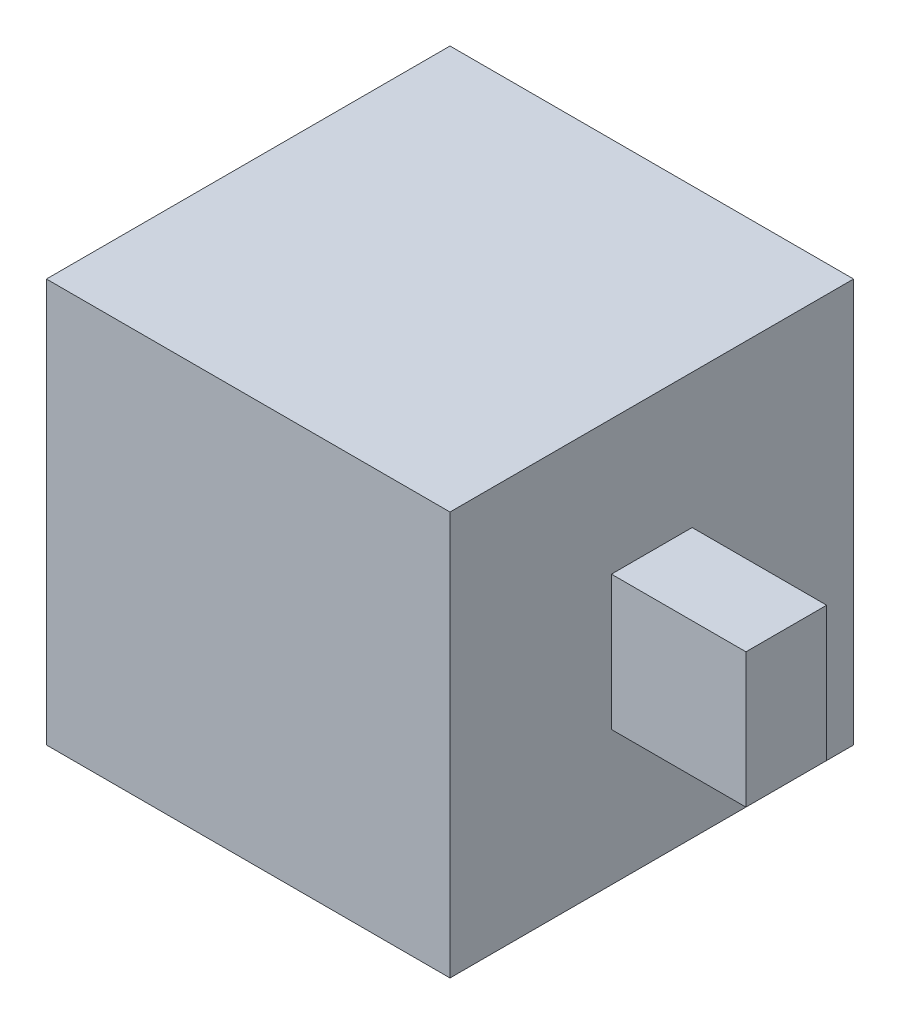
ISO-10303-21;
HEADER;
FILE_DESCRIPTION(('STEP AP214'),'2;1');
FILE_NAME('part.step','',(''),(''),'','','');
FILE_SCHEMA(('AUTOMOTIVE_DESIGN { 1 0 10303 214 1 1 1 1 }'));
ENDSEC;
DATA;
#1=APPLICATION_CONTEXT('core data for automotive mechanical design processes');
#2=APPLICATION_PROTOCOL_DEFINITION('international standard','automotive_design',2000,#1);
#3=PRODUCT_CONTEXT('',#1,'mechanical');
#4=PRODUCT('Part','Part','',(#3));
#5=PRODUCT_RELATED_PRODUCT_CATEGORY('part','',(#4));
#6=PRODUCT_DEFINITION_FORMATION('','',#4);
#7=PRODUCT_DEFINITION_CONTEXT('part definition',#1,'design');
#8=PRODUCT_DEFINITION('design','',#6,#7);
#9=PRODUCT_DEFINITION_SHAPE('','',#8);
#10=(LENGTH_UNIT() NAMED_UNIT(*) SI_UNIT(.MILLI.,.METRE.));
#11=(NAMED_UNIT(*) PLANE_ANGLE_UNIT() SI_UNIT($,.RADIAN.));
#12=(NAMED_UNIT(*) SI_UNIT($,.STERADIAN.) SOLID_ANGLE_UNIT());
#13=UNCERTAINTY_MEASURE_WITH_UNIT(LENGTH_MEASURE(1.E-05),#10,'distance_accuracy_value','');
#14=(GEOMETRIC_REPRESENTATION_CONTEXT(3) GLOBAL_UNCERTAINTY_ASSIGNED_CONTEXT((#13)) GLOBAL_UNIT_ASSIGNED_CONTEXT((#10,
#11,#12)) REPRESENTATION_CONTEXT('',''));
#15=CARTESIAN_POINT('',(0.,0.,0.));
#16=DIRECTION('',(0.,0.,1.));
#17=DIRECTION('',(1.,0.,0.));
#18=AXIS2_PLACEMENT_3D('',#15,#16,#17);
#19=CARTESIAN_POINT('',(30.,0.,0.));
#20=DIRECTION('',(-1.,0.,0.));
#21=DIRECTION('',(0.,0.,1.));
#22=AXIS2_PLACEMENT_3D('',#19,#20,#21);
#23=PLANE('',#22);
#24=DIRECTION('',(0.,-1.,0.));
#25=VECTOR('',#24,1.);
#26=CARTESIAN_POINT('',(30.,0.,0.));
#27=LINE('',#26,#25);
#28=CARTESIAN_POINT('',(30.,30.,0.));
#29=VERTEX_POINT('',#28);
#30=CARTESIAN_POINT('',(30.,0.,0.));
#31=VERTEX_POINT('',#30);
#32=EDGE_CURVE('E144',#29,#31,#27,.T.);
#33=ORIENTED_EDGE('',*,*,#32,.T.);
#34=DIRECTION('',(0.,0.,-1.));
#35=VECTOR('',#34,1.);
#36=CARTESIAN_POINT('',(30.,0.,0.));
#37=LINE('',#36,#35);
#38=CARTESIAN_POINT('',(30.,0.,-30.));
#39=VERTEX_POINT('',#38);
#40=EDGE_CURVE('E148',#31,#39,#37,.T.);
#41=ORIENTED_EDGE('',*,*,#40,.T.);
#42=DIRECTION('',(0.,1.,0.));
#43=VECTOR('',#42,1.);
#44=CARTESIAN_POINT('',(30.,0.,-30.));
#45=LINE('',#44,#43);
#46=CARTESIAN_POINT('',(30.,30.,-30.));
#47=VERTEX_POINT('',#46);
#48=EDGE_CURVE('E152',#39,#47,#45,.T.);
#49=ORIENTED_EDGE('',*,*,#48,.T.);
#50=DIRECTION('',(0.,0.,1.));
#51=VECTOR('',#50,1.);
#52=CARTESIAN_POINT('',(30.,30.,0.));
#53=LINE('',#52,#51);
#54=EDGE_CURVE('E155',#47,#29,#53,.T.);
#55=ORIENTED_EDGE('',*,*,#54,.T.);
#56=EDGE_LOOP('',(#33,#41,#49,#55));
#57=FACE_BOUND('',#56,.T.);
#58=DIRECTION('',(0.,-1.,0.));
#59=VECTOR('',#58,1.);
#60=CARTESIAN_POINT('',(30.,20.,-12.));
#61=LINE('',#60,#59);
#62=CARTESIAN_POINT('',(30.,20.,-12.));
#63=VERTEX_POINT('',#62);
#64=CARTESIAN_POINT('',(30.,10.,-12.));
#65=VERTEX_POINT('',#64);
#66=EDGE_CURVE('E59',#63,#65,#61,.T.);
#67=ORIENTED_EDGE('',*,*,#66,.F.);
#68=DIRECTION('',(0.,0.,-1.));
#69=VECTOR('',#68,1.);
#70=CARTESIAN_POINT('',(30.,20.,-12.));
#71=LINE('',#70,#69);
#72=CARTESIAN_POINT('',(30.,20.,-18.));
#73=VERTEX_POINT('',#72);
#74=EDGE_CURVE('E64',#63,#73,#71,.T.);
#75=ORIENTED_EDGE('',*,*,#74,.T.);
#76=DIRECTION('',(0.,-1.,0.));
#77=VECTOR('',#76,1.);
#78=CARTESIAN_POINT('',(30.,20.,-18.));
#79=LINE('',#78,#77);
#80=CARTESIAN_POINT('',(30.,10.,-18.));
#81=VERTEX_POINT('',#80);
#82=EDGE_CURVE('E309',#73,#81,#79,.T.);
#83=ORIENTED_EDGE('',*,*,#82,.T.);
#84=DIRECTION('',(0.,0.,-1.));
#85=VECTOR('',#84,1.);
#86=CARTESIAN_POINT('',(30.,10.,-12.));
#87=LINE('',#86,#85);
#88=EDGE_CURVE('E312',#65,#81,#87,.T.);
#89=ORIENTED_EDGE('',*,*,#88,.F.);
#90=EDGE_LOOP('',(#67,#75,#83,#89));
#91=FACE_BOUND('',#90,.T.);
#92=ADVANCED_FACE('F43',(#57,#91),#23,.F.);
#93=CARTESIAN_POINT('',(30.,0.,0.));
#94=DIRECTION('',(0.,0.,-1.));
#95=DIRECTION('',(0.,1.,0.));
#96=AXIS2_PLACEMENT_3D('',#93,#94,#95);
#97=PLANE('',#96);
#98=DIRECTION('',(0.,-1.,0.));
#99=VECTOR('',#98,1.);
#100=CARTESIAN_POINT('',(0.,0.,0.));
#101=LINE('',#100,#99);
#102=CARTESIAN_POINT('',(0.,30.,0.));
#103=VERTEX_POINT('',#102);
#104=CARTESIAN_POINT('',(0.,0.,0.));
#105=VERTEX_POINT('',#104);
#106=EDGE_CURVE('E133',#103,#105,#101,.T.);
#107=ORIENTED_EDGE('',*,*,#106,.T.);
#108=DIRECTION('',(-1.,0.,0.));
#109=VECTOR('',#108,1.);
#110=CARTESIAN_POINT('',(30.,0.,0.));
#111=LINE('',#110,#109);
#112=EDGE_CURVE('E11',#31,#105,#111,.T.);
#113=ORIENTED_EDGE('',*,*,#112,.F.);
#114=ORIENTED_EDGE('',*,*,#32,.F.);
#115=DIRECTION('',(-1.,0.,0.));
#116=VECTOR('',#115,1.);
#117=CARTESIAN_POINT('',(30.,30.,0.));
#118=LINE('',#117,#116);
#119=EDGE_CURVE('E157',#29,#103,#118,.T.);
#120=ORIENTED_EDGE('',*,*,#119,.T.);
#121=EDGE_LOOP('',(#107,#113,#114,#120));
#122=FACE_BOUND('',#121,.T.);
#123=ADVANCED_FACE('F45',(#122),#97,.F.);
#124=CARTESIAN_POINT('',(30.,0.,0.));
#125=DIRECTION('',(0.,1.,0.));
#126=DIRECTION('',(0.,0.,1.));
#127=AXIS2_PLACEMENT_3D('',#124,#125,#126);
#128=PLANE('',#127);
#129=DIRECTION('',(0.,0.,-1.));
#130=VECTOR('',#129,1.);
#131=CARTESIAN_POINT('',(0.,0.,0.));
#132=LINE('',#131,#130);
#133=CARTESIAN_POINT('',(0.,0.,-30.));
#134=VERTEX_POINT('',#133);
#135=EDGE_CURVE('E138',#105,#134,#132,.T.);
#136=ORIENTED_EDGE('',*,*,#135,.T.);
#137=DIRECTION('',(-1.,0.,0.));
#138=VECTOR('',#137,1.);
#139=CARTESIAN_POINT('',(30.,0.,-30.));
#140=LINE('',#139,#138);
#141=EDGE_CURVE('E52',#39,#134,#140,.T.);
#142=ORIENTED_EDGE('',*,*,#141,.F.);
#143=ORIENTED_EDGE('',*,*,#40,.F.);
#144=ORIENTED_EDGE('',*,*,#112,.T.);
#145=EDGE_LOOP('',(#136,#142,#143,#144));
#146=FACE_BOUND('',#145,.T.);
#147=ADVANCED_FACE('F193',(#146),#128,.F.);
#148=CARTESIAN_POINT('',(30.,0.,-30.));
#149=DIRECTION('',(0.,0.,1.));
#150=DIRECTION('',(0.,-1.,0.));
#151=AXIS2_PLACEMENT_3D('',#148,#149,#150);
#152=PLANE('',#151);
#153=DIRECTION('',(0.,1.,0.));
#154=VECTOR('',#153,1.);
#155=CARTESIAN_POINT('',(0.,0.,-30.));
#156=LINE('',#155,#154);
#157=CARTESIAN_POINT('',(0.,30.,-30.));
#158=VERTEX_POINT('',#157);
#159=EDGE_CURVE('E161',#134,#158,#156,.T.);
#160=ORIENTED_EDGE('',*,*,#159,.T.);
#161=DIRECTION('',(-1.,0.,0.));
#162=VECTOR('',#161,1.);
#163=CARTESIAN_POINT('',(30.,30.,-30.));
#164=LINE('',#163,#162);
#165=EDGE_CURVE('E169',#47,#158,#164,.T.);
#166=ORIENTED_EDGE('',*,*,#165,.F.);
#167=ORIENTED_EDGE('',*,*,#48,.F.);
#168=ORIENTED_EDGE('',*,*,#141,.T.);
#169=EDGE_LOOP('',(#160,#166,#167,#168));
#170=FACE_BOUND('',#169,.T.);
#171=ADVANCED_FACE('F178',(#170),#152,.F.);
#172=CARTESIAN_POINT('',(30.,30.,0.));
#173=DIRECTION('',(0.,-1.,0.));
#174=DIRECTION('',(0.,0.,-1.));
#175=AXIS2_PLACEMENT_3D('',#172,#173,#174);
#176=PLANE('',#175);
#177=DIRECTION('',(0.,0.,1.));
#178=VECTOR('',#177,1.);
#179=CARTESIAN_POINT('',(0.,30.,0.));
#180=LINE('',#179,#178);
#181=EDGE_CURVE('E149',#158,#103,#180,.T.);
#182=ORIENTED_EDGE('',*,*,#181,.T.);
#183=ORIENTED_EDGE('',*,*,#119,.F.);
#184=ORIENTED_EDGE('',*,*,#54,.F.);
#185=ORIENTED_EDGE('',*,*,#165,.T.);
#186=EDGE_LOOP('',(#182,#183,#184,#185));
#187=FACE_BOUND('',#186,.T.);
#188=ADVANCED_FACE('F187',(#187),#176,.F.);
#189=CARTESIAN_POINT('',(0.,0.,0.));
#190=DIRECTION('',(-1.,0.,0.));
#191=DIRECTION('',(0.,0.,1.));
#192=AXIS2_PLACEMENT_3D('',#189,#190,#191);
#193=PLANE('',#192);
#194=ORIENTED_EDGE('',*,*,#106,.F.);
#195=ORIENTED_EDGE('',*,*,#181,.F.);
#196=ORIENTED_EDGE('',*,*,#159,.F.);
#197=ORIENTED_EDGE('',*,*,#135,.F.);
#198=EDGE_LOOP('',(#194,#195,#196,#197));
#199=FACE_BOUND('',#198,.T.);
#200=ADVANCED_FACE('F184',(#199),#193,.T.);
#201=CARTESIAN_POINT('',(40.,20.,-12.));
#202=DIRECTION('',(0.,0.,-1.));
#203=DIRECTION('',(0.,1.,0.));
#204=AXIS2_PLACEMENT_3D('',#201,#202,#203);
#205=PLANE('',#204);
#206=ORIENTED_EDGE('',*,*,#66,.T.);
#207=DIRECTION('',(-1.,0.,0.));
#208=VECTOR('',#207,1.);
#209=CARTESIAN_POINT('',(40.,10.,-12.));
#210=LINE('',#209,#208);
#211=CARTESIAN_POINT('',(40.,10.,-12.));
#212=VERTEX_POINT('',#211);
#213=EDGE_CURVE('E113',#212,#65,#210,.T.);
#214=ORIENTED_EDGE('',*,*,#213,.F.);
#215=DIRECTION('',(0.,-1.,0.));
#216=VECTOR('',#215,1.);
#217=CARTESIAN_POINT('',(40.,20.,-12.));
#218=LINE('',#217,#216);
#219=CARTESIAN_POINT('',(40.,20.,-12.));
#220=VERTEX_POINT('',#219);
#221=EDGE_CURVE('E121',#220,#212,#218,.T.);
#222=ORIENTED_EDGE('',*,*,#221,.F.);
#223=DIRECTION('',(-1.,0.,0.));
#224=VECTOR('',#223,1.);
#225=CARTESIAN_POINT('',(40.,20.,-12.));
#226=LINE('',#225,#224);
#227=EDGE_CURVE('E306',#220,#63,#226,.T.);
#228=ORIENTED_EDGE('',*,*,#227,.T.);
#229=EDGE_LOOP('',(#206,#214,#222,#228));
#230=FACE_BOUND('',#229,.T.);
#231=ADVANCED_FACE('F131',(#230),#205,.F.);
#232=CARTESIAN_POINT('',(40.,10.,-12.));
#233=DIRECTION('',(0.,1.,0.));
#234=DIRECTION('',(0.,0.,1.));
#235=AXIS2_PLACEMENT_3D('',#232,#233,#234);
#236=PLANE('',#235);
#237=ORIENTED_EDGE('',*,*,#88,.T.);
#238=DIRECTION('',(-1.,0.,0.));
#239=VECTOR('',#238,1.);
#240=CARTESIAN_POINT('',(40.,10.,-18.));
#241=LINE('',#240,#239);
#242=CARTESIAN_POINT('',(40.,10.,-18.));
#243=VERTEX_POINT('',#242);
#244=EDGE_CURVE('E115',#243,#81,#241,.T.);
#245=ORIENTED_EDGE('',*,*,#244,.F.);
#246=DIRECTION('',(0.,0.,-1.));
#247=VECTOR('',#246,1.);
#248=CARTESIAN_POINT('',(40.,10.,-12.));
#249=LINE('',#248,#247);
#250=EDGE_CURVE('E108',#212,#243,#249,.T.);
#251=ORIENTED_EDGE('',*,*,#250,.F.);
#252=ORIENTED_EDGE('',*,*,#213,.T.);
#253=EDGE_LOOP('',(#237,#245,#251,#252));
#254=FACE_BOUND('',#253,.T.);
#255=ADVANCED_FACE('F111',(#254),#236,.F.);
#256=CARTESIAN_POINT('',(40.,20.,-18.));
#257=DIRECTION('',(0.,0.,-1.));
#258=DIRECTION('',(-1.,0.,0.));
#259=AXIS2_PLACEMENT_3D('',#256,#257,#258);
#260=PLANE('',#259);
#261=ORIENTED_EDGE('',*,*,#82,.F.);
#262=DIRECTION('',(-1.,0.,0.));
#263=VECTOR('',#262,1.);
#264=CARTESIAN_POINT('',(40.,20.,-18.));
#265=LINE('',#264,#263);
#266=CARTESIAN_POINT('',(40.,20.,-18.));
#267=VERTEX_POINT('',#266);
#268=EDGE_CURVE('E140',#267,#73,#265,.T.);
#269=ORIENTED_EDGE('',*,*,#268,.F.);
#270=DIRECTION('',(0.,-1.,0.));
#271=VECTOR('',#270,1.);
#272=CARTESIAN_POINT('',(40.,20.,-18.));
#273=LINE('',#272,#271);
#274=EDGE_CURVE('E120',#267,#243,#273,.T.);
#275=ORIENTED_EDGE('',*,*,#274,.T.);
#276=ORIENTED_EDGE('',*,*,#244,.T.);
#277=EDGE_LOOP('',(#261,#269,#275,#276));
#278=FACE_BOUND('',#277,.T.);
#279=ADVANCED_FACE('F229',(#278),#260,.T.);
#280=CARTESIAN_POINT('',(40.,20.,-12.));
#281=DIRECTION('',(0.,1.,0.));
#282=DIRECTION('',(0.,0.,1.));
#283=AXIS2_PLACEMENT_3D('',#280,#281,#282);
#284=PLANE('',#283);
#285=ORIENTED_EDGE('',*,*,#74,.F.);
#286=ORIENTED_EDGE('',*,*,#227,.F.);
#287=DIRECTION('',(0.,0.,-1.));
#288=VECTOR('',#287,1.);
#289=CARTESIAN_POINT('',(40.,20.,-12.));
#290=LINE('',#289,#288);
#291=EDGE_CURVE('E127',#220,#267,#290,.T.);
#292=ORIENTED_EDGE('',*,*,#291,.T.);
#293=ORIENTED_EDGE('',*,*,#268,.T.);
#294=EDGE_LOOP('',(#285,#286,#292,#293));
#295=FACE_BOUND('',#294,.T.);
#296=ADVANCED_FACE('F235',(#295),#284,.T.);
#297=CARTESIAN_POINT('',(40.,0.,0.));
#298=DIRECTION('',(1.,0.,0.));
#299=DIRECTION('',(0.,0.,-1.));
#300=AXIS2_PLACEMENT_3D('',#297,#298,#299);
#301=PLANE('',#300);
#302=ORIENTED_EDGE('',*,*,#221,.T.);
#303=ORIENTED_EDGE('',*,*,#250,.T.);
#304=ORIENTED_EDGE('',*,*,#274,.F.);
#305=ORIENTED_EDGE('',*,*,#291,.F.);
#306=EDGE_LOOP('',(#302,#303,#304,#305));
#307=FACE_BOUND('',#306,.T.);
#308=ADVANCED_FACE('F125',(#307),#301,.T.);
#309=CLOSED_SHELL('',(#92,#123,#147,#171,#188,#200,#231,#255,#279,#296,#308));
#310=MANIFOLD_SOLID_BREP('B2',#309);
#311=ADVANCED_BREP_SHAPE_REPRESENTATION('',(#18,#310),#14);
#312=SHAPE_DEFINITION_REPRESENTATION(#9,#311);
ENDSEC;
END-ISO-10303-21;
